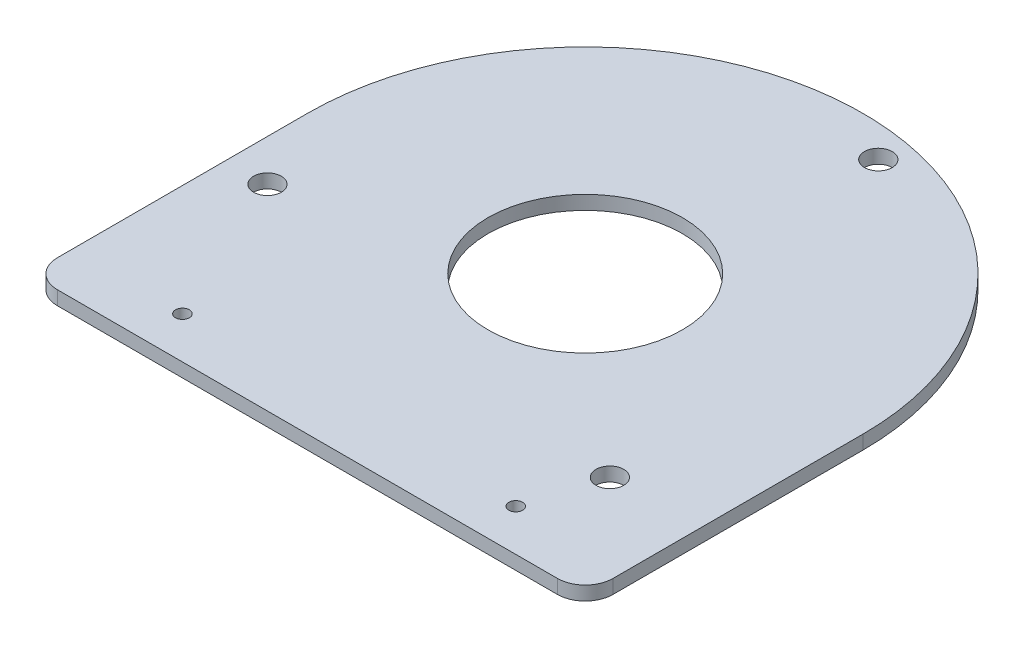
ISO-10303-21;
HEADER;
FILE_DESCRIPTION(('STEP AP214'),'2;1');
FILE_NAME('part.step','',(''),(''),'','','');
FILE_SCHEMA(('AUTOMOTIVE_DESIGN { 1 0 10303 214 1 1 1 1 }'));
ENDSEC;
DATA;
#1=APPLICATION_CONTEXT('core data for automotive mechanical design processes');
#2=APPLICATION_PROTOCOL_DEFINITION('international standard','automotive_design',2000,#1);
#3=PRODUCT_CONTEXT('',#1,'mechanical');
#4=PRODUCT('Part','Part','',(#3));
#5=PRODUCT_RELATED_PRODUCT_CATEGORY('part','',(#4));
#6=PRODUCT_DEFINITION_FORMATION('','',#4);
#7=PRODUCT_DEFINITION_CONTEXT('part definition',#1,'design');
#8=PRODUCT_DEFINITION('design','',#6,#7);
#9=PRODUCT_DEFINITION_SHAPE('','',#8);
#10=(LENGTH_UNIT() NAMED_UNIT(*) SI_UNIT(.MILLI.,.METRE.));
#11=(NAMED_UNIT(*) PLANE_ANGLE_UNIT() SI_UNIT($,.RADIAN.));
#12=(NAMED_UNIT(*) SI_UNIT($,.STERADIAN.) SOLID_ANGLE_UNIT());
#13=UNCERTAINTY_MEASURE_WITH_UNIT(LENGTH_MEASURE(1.E-05),#10,'distance_accuracy_value','');
#14=(GEOMETRIC_REPRESENTATION_CONTEXT(3) GLOBAL_UNCERTAINTY_ASSIGNED_CONTEXT((#13)) GLOBAL_UNIT_ASSIGNED_CONTEXT((#10,
#11,#12)) REPRESENTATION_CONTEXT('',''));
#15=CARTESIAN_POINT('',(0.,0.,0.));
#16=DIRECTION('',(0.,0.,1.));
#17=DIRECTION('',(1.,0.,0.));
#18=AXIS2_PLACEMENT_3D('',#15,#16,#17);
#19=CARTESIAN_POINT('',(-114.3,6.35,114.3));
#20=DIRECTION('',(0.,-1.,0.));
#21=DIRECTION('',(0.,0.,-1.));
#22=AXIS2_PLACEMENT_3D('',#19,#20,#21);
#23=PLANE('',#22);
#24=CARTESIAN_POINT('',(-114.3,6.35,114.3));
#25=DIRECTION('',(0.,1.,0.));
#26=DIRECTION('',(0.,0.,-1.));
#27=AXIS2_PLACEMENT_3D('',#24,#25,#26);
#28=CIRCLE('',#27,12.7);
#29=CARTESIAN_POINT('',(-127.,6.35,114.3));
#30=VERTEX_POINT('',#29);
#31=CARTESIAN_POINT('',(-114.3,6.35,127.));
#32=VERTEX_POINT('',#31);
#33=EDGE_CURVE('E131',#30,#32,#28,.T.);
#34=ORIENTED_EDGE('',*,*,#33,.T.);
#35=DIRECTION('',(1.,0.,0.));
#36=VECTOR('',#35,1.);
#37=CARTESIAN_POINT('',(-114.3,6.35,127.));
#38=LINE('',#37,#36);
#39=CARTESIAN_POINT('',(114.3,6.35,127.));
#40=VERTEX_POINT('',#39);
#41=EDGE_CURVE('E89',#32,#40,#38,.T.);
#42=ORIENTED_EDGE('',*,*,#41,.T.);
#43=CARTESIAN_POINT('',(114.3,6.35,114.3));
#44=DIRECTION('',(0.,1.,0.));
#45=DIRECTION('',(0.,0.,1.));
#46=AXIS2_PLACEMENT_3D('',#43,#44,#45);
#47=CIRCLE('',#46,12.7);
#48=CARTESIAN_POINT('',(127.,6.35,114.3));
#49=VERTEX_POINT('',#48);
#50=EDGE_CURVE('E102',#40,#49,#47,.T.);
#51=ORIENTED_EDGE('',*,*,#50,.T.);
#52=DIRECTION('',(0.,0.,-1.));
#53=VECTOR('',#52,1.);
#54=CARTESIAN_POINT('',(127.,6.35,0.));
#55=LINE('',#54,#53);
#56=CARTESIAN_POINT('',(127.,6.35,0.));
#57=VERTEX_POINT('',#56);
#58=EDGE_CURVE('E96',#49,#57,#55,.T.);
#59=ORIENTED_EDGE('',*,*,#58,.T.);
#60=CARTESIAN_POINT('',(0.,6.35,0.));
#61=DIRECTION('',(0.,1.,0.));
#62=DIRECTION('',(0.,0.,-1.));
#63=AXIS2_PLACEMENT_3D('',#60,#61,#62);
#64=CIRCLE('',#63,127.);
#65=CARTESIAN_POINT('',(-127.,6.35,0.));
#66=VERTEX_POINT('',#65);
#67=EDGE_CURVE('E100',#57,#66,#64,.T.);
#68=ORIENTED_EDGE('',*,*,#67,.T.);
#69=DIRECTION('',(0.,0.,1.));
#70=VECTOR('',#69,1.);
#71=CARTESIAN_POINT('',(-127.,6.35,0.));
#72=LINE('',#71,#70);
#73=EDGE_CURVE('E52',#66,#30,#72,.T.);
#74=ORIENTED_EDGE('',*,*,#73,.T.);
#75=EDGE_LOOP('',(#34,#42,#51,#59,#68,#74));
#76=FACE_BOUND('',#75,.T.);
#77=CARTESIAN_POINT('',(0.,6.35,0.));
#78=DIRECTION('',(0.,1.,0.));
#79=DIRECTION('',(0.,0.,1.));
#80=AXIS2_PLACEMENT_3D('',#77,#78,#79);
#81=CIRCLE('',#80,44.45);
#82=CARTESIAN_POINT('',(0.,6.35,44.45));
#83=VERTEX_POINT('',#82);
#84=EDGE_CURVE('E124',#83,#83,#81,.T.);
#85=ORIENTED_EDGE('',*,*,#84,.F.);
#86=EDGE_LOOP('',(#85));
#87=FACE_BOUND('',#86,.T.);
#88=CARTESIAN_POINT('',(-108.072773191002,6.35,37.2124400544523));
#89=DIRECTION('',(0.,1.,0.));
#90=DIRECTION('',(0.,0.,1.));
#91=AXIS2_PLACEMENT_3D('',#88,#89,#90);
#92=CIRCLE('',#91,6.35);
#93=CARTESIAN_POINT('',(-108.072773191002,6.35,43.5624400544523));
#94=VERTEX_POINT('',#93);
#95=EDGE_CURVE('E215',#94,#94,#92,.T.);
#96=ORIENTED_EDGE('',*,*,#95,.F.);
#97=EDGE_LOOP('',(#96));
#98=FACE_BOUND('',#97,.T.);
#99=CARTESIAN_POINT('',(-76.2,6.35,107.95));
#100=DIRECTION('',(0.,1.,0.));
#101=DIRECTION('',(0.,0.,-1.));
#102=AXIS2_PLACEMENT_3D('',#99,#100,#101);
#103=CIRCLE('',#102,3.175);
#104=CARTESIAN_POINT('',(-76.2,6.35,104.775));
#105=VERTEX_POINT('',#104);
#106=EDGE_CURVE('E209',#105,#105,#103,.T.);
#107=ORIENTED_EDGE('',*,*,#106,.F.);
#108=EDGE_LOOP('',(#107));
#109=FACE_BOUND('',#108,.T.);
#110=CARTESIAN_POINT('',(76.2,6.35,107.95));
#111=DIRECTION('',(0.,1.,0.));
#112=DIRECTION('',(0.,0.,1.));
#113=AXIS2_PLACEMENT_3D('',#110,#111,#112);
#114=CIRCLE('',#113,3.175);
#115=CARTESIAN_POINT('',(76.2,6.35,111.125));
#116=VERTEX_POINT('',#115);
#117=EDGE_CURVE('E203',#116,#116,#114,.T.);
#118=ORIENTED_EDGE('',*,*,#117,.F.);
#119=EDGE_LOOP('',(#118));
#120=FACE_BOUND('',#119,.T.);
#121=CARTESIAN_POINT('',(21.8094681715398,6.35,-112.199987068068));
#122=DIRECTION('',(0.,1.,0.));
#123=DIRECTION('',(0.,0.,1.));
#124=AXIS2_PLACEMENT_3D('',#121,#122,#123);
#125=CIRCLE('',#124,6.34999999999998);
#126=CARTESIAN_POINT('',(21.8094681715398,6.35,-105.849987068068));
#127=VERTEX_POINT('',#126);
#128=EDGE_CURVE('E197',#127,#127,#125,.T.);
#129=ORIENTED_EDGE('',*,*,#128,.F.);
#130=EDGE_LOOP('',(#129));
#131=FACE_BOUND('',#130,.T.);
#132=CARTESIAN_POINT('',(86.2633050194624,6.35,74.9875470136155));
#133=DIRECTION('',(0.,1.,0.));
#134=DIRECTION('',(0.,0.,1.));
#135=AXIS2_PLACEMENT_3D('',#132,#133,#134);
#136=CIRCLE('',#135,6.34999999999999);
#137=CARTESIAN_POINT('',(86.2633050194624,6.35,81.3375470136155));
#138=VERTEX_POINT('',#137);
#139=EDGE_CURVE('E188',#138,#138,#136,.T.);
#140=ORIENTED_EDGE('',*,*,#139,.F.);
#141=EDGE_LOOP('',(#140));
#142=FACE_BOUND('',#141,.T.);
#143=ADVANCED_FACE('F35',(#76,#87,#98,#109,#120,#131,#142),#23,.F.);
#144=CARTESIAN_POINT('',(-114.3,0.,114.3));
#145=DIRECTION('',(0.,-1.,0.));
#146=DIRECTION('',(0.,0.,-1.));
#147=AXIS2_PLACEMENT_3D('',#144,#145,#146);
#148=PLANE('',#147);
#149=CARTESIAN_POINT('',(21.8094681715398,0.,-112.199987068068));
#150=DIRECTION('',(0.,1.,0.));
#151=DIRECTION('',(0.,0.,1.));
#152=AXIS2_PLACEMENT_3D('',#149,#150,#151);
#153=CIRCLE('',#152,6.34999999999998);
#154=CARTESIAN_POINT('',(21.8094681715398,0.,-105.849987068068));
#155=VERTEX_POINT('',#154);
#156=EDGE_CURVE('E194',#155,#155,#153,.T.);
#157=ORIENTED_EDGE('',*,*,#156,.T.);
#158=EDGE_LOOP('',(#157));
#159=FACE_BOUND('',#158,.T.);
#160=CARTESIAN_POINT('',(-76.2,0.,107.95));
#161=DIRECTION('',(0.,1.,0.));
#162=DIRECTION('',(0.,0.,-1.));
#163=AXIS2_PLACEMENT_3D('',#160,#161,#162);
#164=CIRCLE('',#163,3.175);
#165=CARTESIAN_POINT('',(-76.2,0.,104.775));
#166=VERTEX_POINT('',#165);
#167=EDGE_CURVE('E206',#166,#166,#164,.T.);
#168=ORIENTED_EDGE('',*,*,#167,.T.);
#169=EDGE_LOOP('',(#168));
#170=FACE_BOUND('',#169,.T.);
#171=CARTESIAN_POINT('',(0.,0.,0.));
#172=DIRECTION('',(0.,1.,0.));
#173=DIRECTION('',(0.,0.,1.));
#174=AXIS2_PLACEMENT_3D('',#171,#172,#173);
#175=CIRCLE('',#174,44.45);
#176=CARTESIAN_POINT('',(0.,0.,44.45));
#177=VERTEX_POINT('',#176);
#178=EDGE_CURVE('E218',#177,#177,#175,.T.);
#179=ORIENTED_EDGE('',*,*,#178,.T.);
#180=EDGE_LOOP('',(#179));
#181=FACE_BOUND('',#180,.T.);
#182=CARTESIAN_POINT('',(-114.3,0.,114.3));
#183=DIRECTION('',(0.,1.,0.));
#184=DIRECTION('',(0.,0.,-1.));
#185=AXIS2_PLACEMENT_3D('',#182,#183,#184);
#186=CIRCLE('',#185,12.7);
#187=CARTESIAN_POINT('',(-127.,0.,114.3));
#188=VERTEX_POINT('',#187);
#189=CARTESIAN_POINT('',(-114.3,0.,127.));
#190=VERTEX_POINT('',#189);
#191=EDGE_CURVE('E120',#188,#190,#186,.T.);
#192=ORIENTED_EDGE('',*,*,#191,.F.);
#193=DIRECTION('',(0.,0.,1.));
#194=VECTOR('',#193,1.);
#195=CARTESIAN_POINT('',(-127.,0.,0.));
#196=LINE('',#195,#194);
#197=CARTESIAN_POINT('',(-127.,0.,0.));
#198=VERTEX_POINT('',#197);
#199=EDGE_CURVE('E81',#198,#188,#196,.T.);
#200=ORIENTED_EDGE('',*,*,#199,.F.);
#201=CARTESIAN_POINT('',(0.,0.,0.));
#202=DIRECTION('',(0.,1.,0.));
#203=DIRECTION('',(0.,0.,-1.));
#204=AXIS2_PLACEMENT_3D('',#201,#202,#203);
#205=CIRCLE('',#204,127.);
#206=CARTESIAN_POINT('',(127.,0.,0.));
#207=VERTEX_POINT('',#206);
#208=EDGE_CURVE('E75',#207,#198,#205,.T.);
#209=ORIENTED_EDGE('',*,*,#208,.F.);
#210=DIRECTION('',(0.,0.,-1.));
#211=VECTOR('',#210,1.);
#212=CARTESIAN_POINT('',(127.,0.,0.));
#213=LINE('',#212,#211);
#214=CARTESIAN_POINT('',(127.,0.,114.3));
#215=VERTEX_POINT('',#214);
#216=EDGE_CURVE('E110',#215,#207,#213,.T.);
#217=ORIENTED_EDGE('',*,*,#216,.F.);
#218=CARTESIAN_POINT('',(114.3,0.,114.3));
#219=DIRECTION('',(0.,1.,0.));
#220=DIRECTION('',(0.,0.,1.));
#221=AXIS2_PLACEMENT_3D('',#218,#219,#220);
#222=CIRCLE('',#221,12.7);
#223=CARTESIAN_POINT('',(114.3,0.,127.));
#224=VERTEX_POINT('',#223);
#225=EDGE_CURVE('E126',#224,#215,#222,.T.);
#226=ORIENTED_EDGE('',*,*,#225,.F.);
#227=DIRECTION('',(1.,0.,0.));
#228=VECTOR('',#227,1.);
#229=CARTESIAN_POINT('',(-114.3,0.,127.));
#230=LINE('',#229,#228);
#231=EDGE_CURVE('E123',#190,#224,#230,.T.);
#232=ORIENTED_EDGE('',*,*,#231,.F.);
#233=EDGE_LOOP('',(#192,#200,#209,#217,#226,#232));
#234=FACE_BOUND('',#233,.T.);
#235=CARTESIAN_POINT('',(-108.072773191002,0.,37.2124400544523));
#236=DIRECTION('',(0.,1.,0.));
#237=DIRECTION('',(0.,0.,1.));
#238=AXIS2_PLACEMENT_3D('',#235,#236,#237);
#239=CIRCLE('',#238,6.35);
#240=CARTESIAN_POINT('',(-108.072773191002,0.,43.5624400544523));
#241=VERTEX_POINT('',#240);
#242=EDGE_CURVE('E212',#241,#241,#239,.T.);
#243=ORIENTED_EDGE('',*,*,#242,.T.);
#244=EDGE_LOOP('',(#243));
#245=FACE_BOUND('',#244,.T.);
#246=CARTESIAN_POINT('',(76.2,0.,107.95));
#247=DIRECTION('',(0.,1.,0.));
#248=DIRECTION('',(0.,0.,1.));
#249=AXIS2_PLACEMENT_3D('',#246,#247,#248);
#250=CIRCLE('',#249,3.175);
#251=CARTESIAN_POINT('',(76.2,0.,111.125));
#252=VERTEX_POINT('',#251);
#253=EDGE_CURVE('E200',#252,#252,#250,.T.);
#254=ORIENTED_EDGE('',*,*,#253,.T.);
#255=EDGE_LOOP('',(#254));
#256=FACE_BOUND('',#255,.T.);
#257=CARTESIAN_POINT('',(86.2633050194624,0.,74.9875470136155));
#258=DIRECTION('',(0.,1.,0.));
#259=DIRECTION('',(0.,0.,1.));
#260=AXIS2_PLACEMENT_3D('',#257,#258,#259);
#261=CIRCLE('',#260,6.34999999999999);
#262=CARTESIAN_POINT('',(86.2633050194624,0.,81.3375470136155));
#263=VERTEX_POINT('',#262);
#264=EDGE_CURVE('E191',#263,#263,#261,.T.);
#265=ORIENTED_EDGE('',*,*,#264,.T.);
#266=EDGE_LOOP('',(#265));
#267=FACE_BOUND('',#266,.T.);
#268=ADVANCED_FACE('F140',(#159,#170,#181,#234,#245,#256,#267),#148,.T.);
#269=CARTESIAN_POINT('',(-114.3,6.35,114.3));
#270=DIRECTION('',(0.,-1.,0.));
#271=DIRECTION('',(0.,0.,-1.));
#272=AXIS2_PLACEMENT_3D('',#269,#270,#271);
#273=CYLINDRICAL_SURFACE('',#272,12.7);
#274=ORIENTED_EDGE('',*,*,#191,.T.);
#275=DIRECTION('',(0.,-1.,0.));
#276=VECTOR('',#275,1.);
#277=CARTESIAN_POINT('',(-114.3,6.35,127.));
#278=LINE('',#277,#276);
#279=EDGE_CURVE('E11',#32,#190,#278,.T.);
#280=ORIENTED_EDGE('',*,*,#279,.F.);
#281=ORIENTED_EDGE('',*,*,#33,.F.);
#282=DIRECTION('',(0.,-1.,0.));
#283=VECTOR('',#282,1.);
#284=CARTESIAN_POINT('',(-127.,6.35,114.3));
#285=LINE('',#284,#283);
#286=EDGE_CURVE('E116',#30,#188,#285,.T.);
#287=ORIENTED_EDGE('',*,*,#286,.T.);
#288=EDGE_LOOP('',(#274,#280,#281,#287));
#289=FACE_BOUND('',#288,.T.);
#290=ADVANCED_FACE('F37',(#289),#273,.T.);
#291=CARTESIAN_POINT('',(-114.3,6.35,127.));
#292=DIRECTION('',(0.,0.,-1.));
#293=DIRECTION('',(-1.,0.,0.));
#294=AXIS2_PLACEMENT_3D('',#291,#292,#293);
#295=PLANE('',#294);
#296=ORIENTED_EDGE('',*,*,#231,.T.);
#297=DIRECTION('',(0.,-1.,0.));
#298=VECTOR('',#297,1.);
#299=CARTESIAN_POINT('',(114.3,6.35,127.));
#300=LINE('',#299,#298);
#301=EDGE_CURVE('E44',#40,#224,#300,.T.);
#302=ORIENTED_EDGE('',*,*,#301,.F.);
#303=ORIENTED_EDGE('',*,*,#41,.F.);
#304=ORIENTED_EDGE('',*,*,#279,.T.);
#305=EDGE_LOOP('',(#296,#302,#303,#304));
#306=FACE_BOUND('',#305,.T.);
#307=ADVANCED_FACE('F296',(#306),#295,.F.);
#308=CARTESIAN_POINT('',(114.3,6.35,114.3));
#309=DIRECTION('',(0.,-1.,0.));
#310=DIRECTION('',(0.,0.,-1.));
#311=AXIS2_PLACEMENT_3D('',#308,#309,#310);
#312=CYLINDRICAL_SURFACE('',#311,12.7);
#313=ORIENTED_EDGE('',*,*,#225,.T.);
#314=DIRECTION('',(0.,-1.,0.));
#315=VECTOR('',#314,1.);
#316=CARTESIAN_POINT('',(127.,6.35,114.3));
#317=LINE('',#316,#315);
#318=EDGE_CURVE('E111',#49,#215,#317,.T.);
#319=ORIENTED_EDGE('',*,*,#318,.F.);
#320=ORIENTED_EDGE('',*,*,#50,.F.);
#321=ORIENTED_EDGE('',*,*,#301,.T.);
#322=EDGE_LOOP('',(#313,#319,#320,#321));
#323=FACE_BOUND('',#322,.T.);
#324=ADVANCED_FACE('F137',(#323),#312,.T.);
#325=CARTESIAN_POINT('',(127.,6.35,0.));
#326=DIRECTION('',(-1.,0.,0.));
#327=DIRECTION('',(0.,0.,1.));
#328=AXIS2_PLACEMENT_3D('',#325,#326,#327);
#329=PLANE('',#328);
#330=ORIENTED_EDGE('',*,*,#216,.T.);
#331=DIRECTION('',(0.,-1.,0.));
#332=VECTOR('',#331,1.);
#333=CARTESIAN_POINT('',(127.,6.35,0.));
#334=LINE('',#333,#332);
#335=EDGE_CURVE('E107',#57,#207,#334,.T.);
#336=ORIENTED_EDGE('',*,*,#335,.F.);
#337=ORIENTED_EDGE('',*,*,#58,.F.);
#338=ORIENTED_EDGE('',*,*,#318,.T.);
#339=EDGE_LOOP('',(#330,#336,#337,#338));
#340=FACE_BOUND('',#339,.T.);
#341=ADVANCED_FACE('F108',(#340),#329,.F.);
#342=CARTESIAN_POINT('',(0.,6.35,0.));
#343=DIRECTION('',(0.,-1.,0.));
#344=DIRECTION('',(0.,0.,-1.));
#345=AXIS2_PLACEMENT_3D('',#342,#343,#344);
#346=CYLINDRICAL_SURFACE('',#345,127.);
#347=ORIENTED_EDGE('',*,*,#208,.T.);
#348=DIRECTION('',(0.,-1.,0.));
#349=VECTOR('',#348,1.);
#350=CARTESIAN_POINT('',(-127.,6.35,0.));
#351=LINE('',#350,#349);
#352=EDGE_CURVE('E112',#66,#198,#351,.T.);
#353=ORIENTED_EDGE('',*,*,#352,.F.);
#354=ORIENTED_EDGE('',*,*,#67,.F.);
#355=ORIENTED_EDGE('',*,*,#335,.T.);
#356=EDGE_LOOP('',(#347,#353,#354,#355));
#357=FACE_BOUND('',#356,.T.);
#358=ADVANCED_FACE('F114',(#357),#346,.T.);
#359=CARTESIAN_POINT('',(-127.,6.35,0.));
#360=DIRECTION('',(1.,0.,0.));
#361=DIRECTION('',(0.,0.,-1.));
#362=AXIS2_PLACEMENT_3D('',#359,#360,#361);
#363=PLANE('',#362);
#364=ORIENTED_EDGE('',*,*,#199,.T.);
#365=ORIENTED_EDGE('',*,*,#286,.F.);
#366=ORIENTED_EDGE('',*,*,#73,.F.);
#367=ORIENTED_EDGE('',*,*,#352,.T.);
#368=EDGE_LOOP('',(#364,#365,#366,#367));
#369=FACE_BOUND('',#368,.T.);
#370=ADVANCED_FACE('F145',(#369),#363,.F.);
#371=CARTESIAN_POINT('',(0.,6.35,0.));
#372=DIRECTION('',(0.,-1.,0.));
#373=DIRECTION('',(0.,0.,-1.));
#374=AXIS2_PLACEMENT_3D('',#371,#372,#373);
#375=CYLINDRICAL_SURFACE('',#374,44.45);
#376=ORIENTED_EDGE('',*,*,#84,.T.);
#377=EDGE_LOOP('',(#376));
#378=FACE_BOUND('',#377,.T.);
#379=ORIENTED_EDGE('',*,*,#178,.F.);
#380=EDGE_LOOP('',(#379));
#381=FACE_BOUND('',#380,.T.);
#382=ADVANCED_FACE('F147',(#378,#381),#375,.F.);
#383=CARTESIAN_POINT('',(-108.072773191002,6.35,37.2124400544523));
#384=DIRECTION('',(0.,-1.,0.));
#385=DIRECTION('',(0.,0.,-1.));
#386=AXIS2_PLACEMENT_3D('',#383,#384,#385);
#387=CYLINDRICAL_SURFACE('',#386,6.35);
#388=ORIENTED_EDGE('',*,*,#95,.T.);
#389=EDGE_LOOP('',(#388));
#390=FACE_BOUND('',#389,.T.);
#391=ORIENTED_EDGE('',*,*,#242,.F.);
#392=EDGE_LOOP('',(#391));
#393=FACE_BOUND('',#392,.T.);
#394=ADVANCED_FACE('F153',(#390,#393),#387,.F.);
#395=CARTESIAN_POINT('',(-76.2,6.35,107.95));
#396=DIRECTION('',(0.,-1.,0.));
#397=DIRECTION('',(0.,0.,-1.));
#398=AXIS2_PLACEMENT_3D('',#395,#396,#397);
#399=CYLINDRICAL_SURFACE('',#398,3.175);
#400=ORIENTED_EDGE('',*,*,#106,.T.);
#401=EDGE_LOOP('',(#400));
#402=FACE_BOUND('',#401,.T.);
#403=ORIENTED_EDGE('',*,*,#167,.F.);
#404=EDGE_LOOP('',(#403));
#405=FACE_BOUND('',#404,.T.);
#406=ADVANCED_FACE('F167',(#402,#405),#399,.F.);
#407=CARTESIAN_POINT('',(76.2,6.35,107.95));
#408=DIRECTION('',(0.,-1.,0.));
#409=DIRECTION('',(0.,0.,-1.));
#410=AXIS2_PLACEMENT_3D('',#407,#408,#409);
#411=CYLINDRICAL_SURFACE('',#410,3.175);
#412=ORIENTED_EDGE('',*,*,#117,.T.);
#413=EDGE_LOOP('',(#412));
#414=FACE_BOUND('',#413,.T.);
#415=ORIENTED_EDGE('',*,*,#253,.F.);
#416=EDGE_LOOP('',(#415));
#417=FACE_BOUND('',#416,.T.);
#418=ADVANCED_FACE('F171',(#414,#417),#411,.F.);
#419=CARTESIAN_POINT('',(21.8094681715398,6.35,-112.199987068068));
#420=DIRECTION('',(0.,-1.,0.));
#421=DIRECTION('',(0.,0.,-1.));
#422=AXIS2_PLACEMENT_3D('',#419,#420,#421);
#423=CYLINDRICAL_SURFACE('',#422,6.34999999999998);
#424=ORIENTED_EDGE('',*,*,#128,.T.);
#425=EDGE_LOOP('',(#424));
#426=FACE_BOUND('',#425,.T.);
#427=ORIENTED_EDGE('',*,*,#156,.F.);
#428=EDGE_LOOP('',(#427));
#429=FACE_BOUND('',#428,.T.);
#430=ADVANCED_FACE('F175',(#426,#429),#423,.F.);
#431=CARTESIAN_POINT('',(86.2633050194624,6.35,74.9875470136155));
#432=DIRECTION('',(0.,-1.,0.));
#433=DIRECTION('',(0.,0.,-1.));
#434=AXIS2_PLACEMENT_3D('',#431,#432,#433);
#435=CYLINDRICAL_SURFACE('',#434,6.34999999999999);
#436=ORIENTED_EDGE('',*,*,#139,.T.);
#437=EDGE_LOOP('',(#436));
#438=FACE_BOUND('',#437,.T.);
#439=ORIENTED_EDGE('',*,*,#264,.F.);
#440=EDGE_LOOP('',(#439));
#441=FACE_BOUND('',#440,.T.);
#442=ADVANCED_FACE('F179',(#438,#441),#435,.F.);
#443=CLOSED_SHELL('',(#143,#268,#290,#307,#324,#341,#358,#370,#382,#394,#406,#418,#430,#442));
#444=MANIFOLD_SOLID_BREP('B2',#443);
#445=ADVANCED_BREP_SHAPE_REPRESENTATION('',(#18,#444),#14);
#446=SHAPE_DEFINITION_REPRESENTATION(#9,#445);
ENDSEC;
END-ISO-10303-21;
